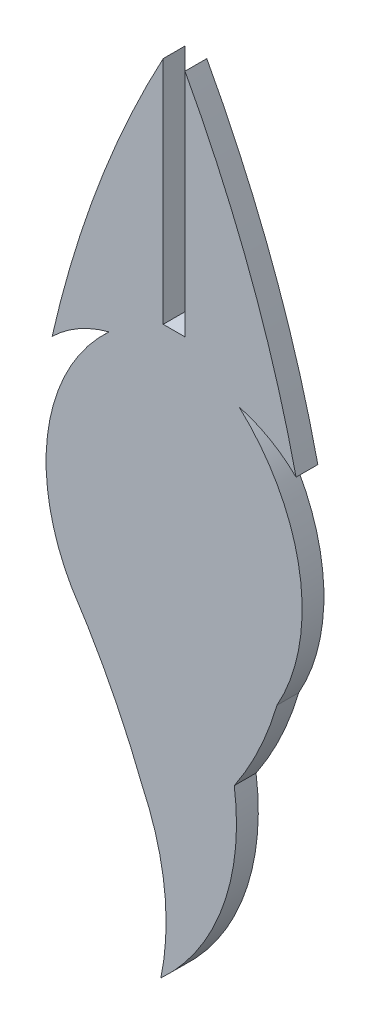
ISO-10303-21;
HEADER;
FILE_DESCRIPTION(('STEP AP214'),'2;1');
FILE_NAME('part.step','',(''),(''),'','','');
FILE_SCHEMA(('AUTOMOTIVE_DESIGN { 1 0 10303 214 1 1 1 1 }'));
ENDSEC;
DATA;
#1=APPLICATION_CONTEXT('core data for automotive mechanical design processes');
#2=APPLICATION_PROTOCOL_DEFINITION('international standard','automotive_design',2000,#1);
#3=PRODUCT_CONTEXT('',#1,'mechanical');
#4=PRODUCT('Part','Part','',(#3));
#5=PRODUCT_RELATED_PRODUCT_CATEGORY('part','',(#4));
#6=PRODUCT_DEFINITION_FORMATION('','',#4);
#7=PRODUCT_DEFINITION_CONTEXT('part definition',#1,'design');
#8=PRODUCT_DEFINITION('design','',#6,#7);
#9=PRODUCT_DEFINITION_SHAPE('','',#8);
#10=(LENGTH_UNIT() NAMED_UNIT(*) SI_UNIT(.MILLI.,.METRE.));
#11=(NAMED_UNIT(*) PLANE_ANGLE_UNIT() SI_UNIT($,.RADIAN.));
#12=(NAMED_UNIT(*) SI_UNIT($,.STERADIAN.) SOLID_ANGLE_UNIT());
#13=UNCERTAINTY_MEASURE_WITH_UNIT(LENGTH_MEASURE(1.E-05),#10,'distance_accuracy_value','');
#14=(GEOMETRIC_REPRESENTATION_CONTEXT(3) GLOBAL_UNCERTAINTY_ASSIGNED_CONTEXT((#13)) GLOBAL_UNIT_ASSIGNED_CONTEXT((#10,
#11,#12)) REPRESENTATION_CONTEXT('',''));
#15=CARTESIAN_POINT('',(0.,0.,0.));
#16=DIRECTION('',(0.,0.,1.));
#17=DIRECTION('',(1.,0.,0.));
#18=AXIS2_PLACEMENT_3D('',#15,#16,#17);
#19=CARTESIAN_POINT('',(-1.52400000000001,-18.5816019142866,1.524));
#20=DIRECTION('',(-1.,0.,0.));
#21=DIRECTION('',(0.,0.,1.));
#22=AXIS2_PLACEMENT_3D('',#19,#20,#21);
#23=PLANE('',#22);
#24=DIRECTION('',(0.,1.,0.));
#25=VECTOR('',#24,1.);
#26=CARTESIAN_POINT('',(-1.52400000000001,-18.5816019142866,0.));
#27=LINE('',#26,#25);
#28=CARTESIAN_POINT('',(-1.52400000000001,-34.6762018191849,0.));
#29=VERTEX_POINT('',#28);
#30=CARTESIAN_POINT('',(-1.524,-18.5816019142866,0.));
#31=VERTEX_POINT('',#30);
#32=EDGE_CURVE('E162',#29,#31,#27,.T.);
#33=ORIENTED_EDGE('',*,*,#32,.T.);
#34=DIRECTION('',(0.,0.,-1.));
#35=VECTOR('',#34,1.);
#36=CARTESIAN_POINT('',(-1.524,-18.5816019142866,1.524));
#37=LINE('',#36,#35);
#38=CARTESIAN_POINT('',(-1.524,-18.5816019142866,1.524));
#39=VERTEX_POINT('',#38);
#40=EDGE_CURVE('E11',#39,#31,#37,.T.);
#41=ORIENTED_EDGE('',*,*,#40,.F.);
#42=DIRECTION('',(0.,1.,0.));
#43=VECTOR('',#42,1.);
#44=CARTESIAN_POINT('',(-1.52400000000001,-18.5816019142866,1.524));
#45=LINE('',#44,#43);
#46=CARTESIAN_POINT('',(-1.52400000000001,-34.6762018191849,1.524));
#47=VERTEX_POINT('',#46);
#48=EDGE_CURVE('E186',#47,#39,#45,.T.);
#49=ORIENTED_EDGE('',*,*,#48,.F.);
#50=DIRECTION('',(0.,0.,-1.));
#51=VECTOR('',#50,1.);
#52=CARTESIAN_POINT('',(-1.52400000000001,-34.6762018191849,1.524));
#53=LINE('',#52,#51);
#54=EDGE_CURVE('E158',#47,#29,#53,.T.);
#55=ORIENTED_EDGE('',*,*,#54,.T.);
#56=EDGE_LOOP('',(#33,#41,#49,#55));
#57=FACE_BOUND('',#56,.T.);
#58=ADVANCED_FACE('F36',(#57),#23,.F.);
#59=CARTESIAN_POINT('',(70.4453125153491,-57.3849255412965,1.524));
#60=DIRECTION('',(0.,0.,-1.));
#61=DIRECTION('',(-1.,0.,0.));
#62=AXIS2_PLACEMENT_3D('',#59,#60,#61);
#63=CYLINDRICAL_SURFACE('',#62,81.7635607617138);
#64=CARTESIAN_POINT('',(70.4453125153491,-57.3849255412965,0.));
#65=DIRECTION('',(0.,0.,1.));
#66=DIRECTION('',(1.,0.,0.));
#67=AXIS2_PLACEMENT_3D('',#64,#65,#66);
#68=CIRCLE('',#67,81.7635607617138);
#69=CARTESIAN_POINT('',(-9.29048030385663,-39.2884283131822,0.));
#70=VERTEX_POINT('',#69);
#71=EDGE_CURVE('E165',#31,#70,#68,.T.);
#72=ORIENTED_EDGE('',*,*,#71,.T.);
#73=DIRECTION('',(0.,0.,-1.));
#74=VECTOR('',#73,1.);
#75=CARTESIAN_POINT('',(-9.29048030385663,-39.2884283131822,1.524));
#76=LINE('',#75,#74);
#77=CARTESIAN_POINT('',(-9.29048030385663,-39.2884283131822,1.524));
#78=VERTEX_POINT('',#77);
#79=EDGE_CURVE('E44',#78,#70,#76,.T.);
#80=ORIENTED_EDGE('',*,*,#79,.F.);
#81=CARTESIAN_POINT('',(70.4453125153491,-57.3849255412965,1.524));
#82=DIRECTION('',(0.,0.,1.));
#83=DIRECTION('',(1.,0.,0.));
#84=AXIS2_PLACEMENT_3D('',#81,#82,#83);
#85=CIRCLE('',#84,81.7635607617138);
#86=EDGE_CURVE('E110',#39,#78,#85,.T.);
#87=ORIENTED_EDGE('',*,*,#86,.F.);
#88=ORIENTED_EDGE('',*,*,#40,.T.);
#89=EDGE_LOOP('',(#72,#80,#87,#88));
#90=FACE_BOUND('',#89,.T.);
#91=ADVANCED_FACE('F269',(#90),#63,.T.);
#92=CARTESIAN_POINT('',(-3.00506683337598,-45.7155767584329,1.524));
#93=DIRECTION('',(0.,0.,-1.));
#94=DIRECTION('',(-1.,0.,0.));
#95=AXIS2_PLACEMENT_3D('',#92,#93,#94);
#96=CYLINDRICAL_SURFACE('',#95,8.98969741605289);
#97=CARTESIAN_POINT('',(-3.00506683337598,-45.7155767584329,0.));
#98=DIRECTION('',(0.,0.,-1.));
#99=DIRECTION('',(-1.,0.,0.));
#100=AXIS2_PLACEMENT_3D('',#97,#98,#99);
#101=CIRCLE('',#100,8.98969741605289);
#102=CARTESIAN_POINT('',(-5.30879681582961,-37.0260722961443,0.));
#103=VERTEX_POINT('',#102);
#104=EDGE_CURVE('E167',#70,#103,#101,.T.);
#105=ORIENTED_EDGE('',*,*,#104,.T.);
#106=DIRECTION('',(0.,0.,-1.));
#107=VECTOR('',#106,1.);
#108=CARTESIAN_POINT('',(-5.30879681582961,-37.0260722961443,1.524));
#109=LINE('',#108,#107);
#110=CARTESIAN_POINT('',(-5.30879681582961,-37.0260722961443,1.524));
#111=VERTEX_POINT('',#110);
#112=EDGE_CURVE('E208',#111,#103,#109,.T.);
#113=ORIENTED_EDGE('',*,*,#112,.F.);
#114=CARTESIAN_POINT('',(-3.00506683337598,-45.7155767584329,1.524));
#115=DIRECTION('',(0.,0.,-1.));
#116=DIRECTION('',(-1.,0.,0.));
#117=AXIS2_PLACEMENT_3D('',#114,#115,#116);
#118=CIRCLE('',#117,8.98969741605289);
#119=EDGE_CURVE('E216',#78,#111,#118,.T.);
#120=ORIENTED_EDGE('',*,*,#119,.F.);
#121=ORIENTED_EDGE('',*,*,#79,.T.);
#122=EDGE_LOOP('',(#105,#113,#120,#121));
#123=FACE_BOUND('',#122,.T.);
#124=ADVANCED_FACE('F214',(#123),#96,.F.);
#125=CARTESIAN_POINT('',(3.92555912112317,-47.0659354865016,1.524));
#126=DIRECTION('',(0.,0.,-1.));
#127=DIRECTION('',(-1.,0.,0.));
#128=AXIS2_PLACEMENT_3D('',#125,#126,#127);
#129=CYLINDRICAL_SURFACE('',#128,13.6408277773537);
#130=CARTESIAN_POINT('',(3.92555912112317,-47.0659354865016,0.));
#131=DIRECTION('',(0.,0.,1.));
#132=DIRECTION('',(1.,0.,0.));
#133=AXIS2_PLACEMENT_3D('',#130,#131,#132);
#134=CIRCLE('',#133,13.6408277773537);
#135=CARTESIAN_POINT('',(-7.95329549132107,-53.7715298335999,0.));
#136=VERTEX_POINT('',#135);
#137=EDGE_CURVE('E169',#103,#136,#134,.T.);
#138=ORIENTED_EDGE('',*,*,#137,.T.);
#139=DIRECTION('',(0.,0.,-1.));
#140=VECTOR('',#139,1.);
#141=CARTESIAN_POINT('',(-7.95329549132107,-53.7715298335999,1.524));
#142=LINE('',#141,#140);
#143=CARTESIAN_POINT('',(-7.95329549132107,-53.7715298335999,1.524));
#144=VERTEX_POINT('',#143);
#145=EDGE_CURVE('E205',#144,#136,#142,.T.);
#146=ORIENTED_EDGE('',*,*,#145,.F.);
#147=CARTESIAN_POINT('',(3.92555912112317,-47.0659354865016,1.524));
#148=DIRECTION('',(0.,0.,1.));
#149=DIRECTION('',(1.,0.,0.));
#150=AXIS2_PLACEMENT_3D('',#147,#148,#149);
#151=CIRCLE('',#150,13.6408277773537);
#152=EDGE_CURVE('E234',#111,#144,#151,.T.);
#153=ORIENTED_EDGE('',*,*,#152,.F.);
#154=ORIENTED_EDGE('',*,*,#112,.T.);
#155=EDGE_LOOP('',(#138,#146,#153,#154));
#156=FACE_BOUND('',#155,.T.);
#157=ADVANCED_FACE('F225',(#156),#129,.T.);
#158=CARTESIAN_POINT('',(-50.3528429648545,-81.7940691457981,1.524));
#159=DIRECTION('',(0.,0.,-1.));
#160=DIRECTION('',(-1.,0.,0.));
#161=AXIS2_PLACEMENT_3D('',#158,#159,#160);
#162=CYLINDRICAL_SURFACE('',#161,50.8230689300057);
#163=CARTESIAN_POINT('',(-50.3528429648545,-81.7940691457981,0.));
#164=DIRECTION('',(0.,0.,-1.));
#165=DIRECTION('',(1.,0.,0.));
#166=AXIS2_PLACEMENT_3D('',#163,#164,#165);
#167=CIRCLE('',#166,50.8230689300057);
#168=CARTESIAN_POINT('',(-3.00146917883711,-63.3324403974733,0.));
#169=VERTEX_POINT('',#168);
#170=EDGE_CURVE('E171',#136,#169,#167,.T.);
#171=ORIENTED_EDGE('',*,*,#170,.T.);
#172=DIRECTION('',(0.,0.,-1.));
#173=VECTOR('',#172,1.);
#174=CARTESIAN_POINT('',(-3.00146917883711,-63.3324403974733,1.524));
#175=LINE('',#174,#173);
#176=CARTESIAN_POINT('',(-3.00146917883711,-63.3324403974733,1.524));
#177=VERTEX_POINT('',#176);
#178=EDGE_CURVE('E202',#177,#169,#175,.T.);
#179=ORIENTED_EDGE('',*,*,#178,.F.);
#180=CARTESIAN_POINT('',(-50.3528429648545,-81.7940691457981,1.524));
#181=DIRECTION('',(0.,0.,-1.));
#182=DIRECTION('',(1.,0.,0.));
#183=AXIS2_PLACEMENT_3D('',#180,#181,#182);
#184=CIRCLE('',#183,50.8230689300057);
#185=EDGE_CURVE('E231',#144,#177,#184,.T.);
#186=ORIENTED_EDGE('',*,*,#185,.F.);
#187=ORIENTED_EDGE('',*,*,#145,.T.);
#188=EDGE_LOOP('',(#171,#179,#186,#187));
#189=FACE_BOUND('',#188,.T.);
#190=ADVANCED_FACE('F229',(#189),#162,.F.);
#191=CARTESIAN_POINT('',(-18.7415117303908,-70.7959639340754,1.524));
#192=DIRECTION('',(0.,0.,-1.));
#193=DIRECTION('',(-1.,0.,0.));
#194=AXIS2_PLACEMENT_3D('',#191,#192,#193);
#195=CYLINDRICAL_SURFACE('',#194,17.4199059442391);
#196=CARTESIAN_POINT('',(-18.7415117303908,-70.7959639340754,0.));
#197=DIRECTION('',(0.,0.,-1.));
#198=DIRECTION('',(-1.,0.,0.));
#199=AXIS2_PLACEMENT_3D('',#196,#197,#198);
#200=CIRCLE('',#199,17.4199059442391);
#201=CARTESIAN_POINT('',(-1.68743934656411,-74.3472648553343,0.));
#202=VERTEX_POINT('',#201);
#203=EDGE_CURVE('E173',#169,#202,#200,.T.);
#204=ORIENTED_EDGE('',*,*,#203,.T.);
#205=DIRECTION('',(0.,0.,-1.));
#206=VECTOR('',#205,1.);
#207=CARTESIAN_POINT('',(-1.68743934656411,-74.3472648553343,1.524));
#208=LINE('',#207,#206);
#209=CARTESIAN_POINT('',(-1.68743934656411,-74.3472648553343,1.524));
#210=VERTEX_POINT('',#209);
#211=EDGE_CURVE('E199',#210,#202,#208,.T.);
#212=ORIENTED_EDGE('',*,*,#211,.F.);
#213=CARTESIAN_POINT('',(-18.7415117303908,-70.7959639340754,1.524));
#214=DIRECTION('',(0.,0.,-1.));
#215=DIRECTION('',(-1.,0.,0.));
#216=AXIS2_PLACEMENT_3D('',#213,#214,#215);
#217=CIRCLE('',#216,17.4199059442391);
#218=EDGE_CURVE('E233',#177,#210,#217,.T.);
#219=ORIENTED_EDGE('',*,*,#218,.F.);
#220=ORIENTED_EDGE('',*,*,#178,.T.);
#221=EDGE_LOOP('',(#204,#212,#219,#220));
#222=FACE_BOUND('',#221,.T.);
#223=ADVANCED_FACE('F282',(#222),#195,.F.);
#224=CARTESIAN_POINT('',(-12.5949609513225,-62.3738585730274,1.524));
#225=DIRECTION('',(0.,0.,-1.));
#226=DIRECTION('',(-1.,0.,0.));
#227=AXIS2_PLACEMENT_3D('',#224,#225,#226);
#228=CYLINDRICAL_SURFACE('',#227,16.1968047947568);
#229=CARTESIAN_POINT('',(-12.5949609513225,-62.3738585730274,0.));
#230=DIRECTION('',(0.,0.,1.));
#231=DIRECTION('',(1.,0.,0.));
#232=AXIS2_PLACEMENT_3D('',#229,#230,#231);
#233=CIRCLE('',#232,16.1968047947568);
#234=CARTESIAN_POINT('',(3.44551482274413,-60.1289482182387,0.));
#235=VERTEX_POINT('',#234);
#236=EDGE_CURVE('E175',#202,#235,#233,.T.);
#237=ORIENTED_EDGE('',*,*,#236,.T.);
#238=DIRECTION('',(0.,0.,-1.));
#239=VECTOR('',#238,1.);
#240=CARTESIAN_POINT('',(3.44551482274413,-60.1289482182387,1.524));
#241=LINE('',#240,#239);
#242=CARTESIAN_POINT('',(3.44551482274413,-60.1289482182387,1.524));
#243=VERTEX_POINT('',#242);
#244=EDGE_CURVE('E196',#243,#235,#241,.T.);
#245=ORIENTED_EDGE('',*,*,#244,.F.);
#246=CARTESIAN_POINT('',(-12.5949609513225,-62.3738585730274,1.524));
#247=DIRECTION('',(0.,0.,1.));
#248=DIRECTION('',(1.,0.,0.));
#249=AXIS2_PLACEMENT_3D('',#246,#247,#248);
#250=CIRCLE('',#249,16.1968047947568);
#251=EDGE_CURVE('E236',#210,#243,#250,.T.);
#252=ORIENTED_EDGE('',*,*,#251,.F.);
#253=ORIENTED_EDGE('',*,*,#211,.T.);
#254=EDGE_LOOP('',(#237,#245,#252,#253));
#255=FACE_BOUND('',#254,.T.);
#256=ADVANCED_FACE('F285',(#255),#228,.T.);
#257=CARTESIAN_POINT('',(-15.5241285578103,-47.346855222314,1.524));
#258=DIRECTION('',(0.,0.,-1.));
#259=DIRECTION('',(-1.,0.,0.));
#260=AXIS2_PLACEMENT_3D('',#257,#258,#259);
#261=CYLINDRICAL_SURFACE('',#260,22.8742053707201);
#262=CARTESIAN_POINT('',(-15.5241285578103,-47.346855222314,0.));
#263=DIRECTION('',(0.,0.,1.));
#264=DIRECTION('',(-1.,0.,0.));
#265=AXIS2_PLACEMENT_3D('',#262,#263,#264);
#266=CIRCLE('',#265,22.8742053707201);
#267=CARTESIAN_POINT('',(6.42929549132104,-53.7715298335999,0.));
#268=VERTEX_POINT('',#267);
#269=EDGE_CURVE('E177',#235,#268,#266,.T.);
#270=ORIENTED_EDGE('',*,*,#269,.T.);
#271=DIRECTION('',(0.,0.,-1.));
#272=VECTOR('',#271,1.);
#273=CARTESIAN_POINT('',(6.42929549132104,-53.7715298335999,1.524));
#274=LINE('',#273,#272);
#275=CARTESIAN_POINT('',(6.42929549132104,-53.7715298335999,1.524));
#276=VERTEX_POINT('',#275);
#277=EDGE_CURVE('E193',#276,#268,#274,.T.);
#278=ORIENTED_EDGE('',*,*,#277,.F.);
#279=CARTESIAN_POINT('',(-15.5241285578103,-47.346855222314,1.524));
#280=DIRECTION('',(0.,0.,1.));
#281=DIRECTION('',(-1.,0.,0.));
#282=AXIS2_PLACEMENT_3D('',#279,#280,#281);
#283=CIRCLE('',#282,22.8742053707201);
#284=EDGE_CURVE('E242',#243,#276,#283,.T.);
#285=ORIENTED_EDGE('',*,*,#284,.F.);
#286=ORIENTED_EDGE('',*,*,#244,.T.);
#287=EDGE_LOOP('',(#270,#278,#285,#286));
#288=FACE_BOUND('',#287,.T.);
#289=ADVANCED_FACE('F289',(#288),#261,.T.);
#290=CARTESIAN_POINT('',(-5.44955912112319,-47.0659354865016,1.524));
#291=DIRECTION('',(0.,0.,-1.));
#292=DIRECTION('',(-1.,0.,0.));
#293=AXIS2_PLACEMENT_3D('',#290,#291,#292);
#294=CYLINDRICAL_SURFACE('',#293,13.6408277773537);
#295=CARTESIAN_POINT('',(-5.44955912112319,-47.0659354865016,0.));
#296=DIRECTION('',(0.,0.,1.));
#297=DIRECTION('',(-1.,0.,0.));
#298=AXIS2_PLACEMENT_3D('',#295,#296,#297);
#299=CIRCLE('',#298,13.6408277773537);
#300=CARTESIAN_POINT('',(3.78479681582959,-37.0260722961443,0.));
#301=VERTEX_POINT('',#300);
#302=EDGE_CURVE('E179',#268,#301,#299,.T.);
#303=ORIENTED_EDGE('',*,*,#302,.T.);
#304=DIRECTION('',(0.,0.,-1.));
#305=VECTOR('',#304,1.);
#306=CARTESIAN_POINT('',(3.78479681582959,-37.0260722961443,1.524));
#307=LINE('',#306,#305);
#308=CARTESIAN_POINT('',(3.78479681582959,-37.0260722961443,1.524));
#309=VERTEX_POINT('',#308);
#310=EDGE_CURVE('E190',#309,#301,#307,.T.);
#311=ORIENTED_EDGE('',*,*,#310,.F.);
#312=CARTESIAN_POINT('',(-5.44955912112319,-47.0659354865016,1.524));
#313=DIRECTION('',(0.,0.,1.));
#314=DIRECTION('',(-1.,0.,0.));
#315=AXIS2_PLACEMENT_3D('',#312,#313,#314);
#316=CIRCLE('',#315,13.6408277773537);
#317=EDGE_CURVE('E244',#276,#309,#316,.T.);
#318=ORIENTED_EDGE('',*,*,#317,.F.);
#319=ORIENTED_EDGE('',*,*,#277,.T.);
#320=EDGE_LOOP('',(#303,#311,#318,#319));
#321=FACE_BOUND('',#320,.T.);
#322=ADVANCED_FACE('F250',(#321),#294,.T.);
#323=CARTESIAN_POINT('',(1.48106683337597,-45.7155767584329,1.524));
#324=DIRECTION('',(0.,0.,-1.));
#325=DIRECTION('',(-1.,0.,0.));
#326=AXIS2_PLACEMENT_3D('',#323,#324,#325);
#327=CYLINDRICAL_SURFACE('',#326,8.98969741605289);
#328=CARTESIAN_POINT('',(1.48106683337597,-45.7155767584329,0.));
#329=DIRECTION('',(0.,0.,-1.));
#330=DIRECTION('',(1.,0.,0.));
#331=AXIS2_PLACEMENT_3D('',#328,#329,#330);
#332=CIRCLE('',#331,8.98969741605289);
#333=CARTESIAN_POINT('',(7.76648030385661,-39.2884283131822,0.));
#334=VERTEX_POINT('',#333);
#335=EDGE_CURVE('E181',#301,#334,#332,.T.);
#336=ORIENTED_EDGE('',*,*,#335,.T.);
#337=DIRECTION('',(0.,0.,-1.));
#338=VECTOR('',#337,1.);
#339=CARTESIAN_POINT('',(7.76648030385661,-39.2884283131822,1.524));
#340=LINE('',#339,#338);
#341=CARTESIAN_POINT('',(7.76648030385661,-39.2884283131822,1.524));
#342=VERTEX_POINT('',#341);
#343=EDGE_CURVE('E153',#342,#334,#340,.T.);
#344=ORIENTED_EDGE('',*,*,#343,.F.);
#345=CARTESIAN_POINT('',(1.48106683337597,-45.7155767584329,1.524));
#346=DIRECTION('',(0.,0.,-1.));
#347=DIRECTION('',(1.,0.,0.));
#348=AXIS2_PLACEMENT_3D('',#345,#346,#347);
#349=CIRCLE('',#348,8.98969741605289);
#350=EDGE_CURVE('E144',#309,#342,#349,.T.);
#351=ORIENTED_EDGE('',*,*,#350,.F.);
#352=ORIENTED_EDGE('',*,*,#310,.T.);
#353=EDGE_LOOP('',(#336,#344,#351,#352));
#354=FACE_BOUND('',#353,.T.);
#355=ADVANCED_FACE('F254',(#354),#327,.F.);
#356=CARTESIAN_POINT('',(-71.9693125153492,-57.3849255412965,1.524));
#357=DIRECTION('',(0.,0.,-1.));
#358=DIRECTION('',(-1.,0.,0.));
#359=AXIS2_PLACEMENT_3D('',#356,#357,#358);
#360=CYLINDRICAL_SURFACE('',#359,81.7635607617138);
#361=CARTESIAN_POINT('',(-71.9693125153492,-57.3849255412965,0.));
#362=DIRECTION('',(0.,0.,1.));
#363=DIRECTION('',(-1.,0.,0.));
#364=AXIS2_PLACEMENT_3D('',#361,#362,#363);
#365=CIRCLE('',#364,81.7635607617138);
#366=CARTESIAN_POINT('',(0.,-18.5816019142866,0.));
#367=VERTEX_POINT('',#366);
#368=EDGE_CURVE('E152',#334,#367,#365,.T.);
#369=ORIENTED_EDGE('',*,*,#368,.T.);
#370=DIRECTION('',(0.,0.,-1.));
#371=VECTOR('',#370,1.);
#372=CARTESIAN_POINT('',(0.,-18.5816019142866,1.524));
#373=LINE('',#372,#371);
#374=CARTESIAN_POINT('',(0.,-18.5816019142866,1.524));
#375=VERTEX_POINT('',#374);
#376=EDGE_CURVE('E149',#375,#367,#373,.T.);
#377=ORIENTED_EDGE('',*,*,#376,.F.);
#378=CARTESIAN_POINT('',(-71.9693125153492,-57.3849255412965,1.524));
#379=DIRECTION('',(0.,0.,1.));
#380=DIRECTION('',(-1.,0.,0.));
#381=AXIS2_PLACEMENT_3D('',#378,#379,#380);
#382=CIRCLE('',#381,81.7635607617138);
#383=EDGE_CURVE('E138',#342,#375,#382,.T.);
#384=ORIENTED_EDGE('',*,*,#383,.F.);
#385=ORIENTED_EDGE('',*,*,#343,.T.);
#386=EDGE_LOOP('',(#369,#377,#384,#385));
#387=FACE_BOUND('',#386,.T.);
#388=ADVANCED_FACE('F150',(#387),#360,.T.);
#389=CARTESIAN_POINT('',(0.,-34.6762018191849,1.524));
#390=DIRECTION('',(1.,0.,0.));
#391=DIRECTION('',(0.,1.,0.));
#392=AXIS2_PLACEMENT_3D('',#389,#390,#391);
#393=PLANE('',#392);
#394=DIRECTION('',(0.,-1.,0.));
#395=VECTOR('',#394,1.);
#396=CARTESIAN_POINT('',(0.,-34.6762018191849,0.));
#397=LINE('',#396,#395);
#398=CARTESIAN_POINT('',(0.,-34.6762018191849,0.));
#399=VERTEX_POINT('',#398);
#400=EDGE_CURVE('E96',#367,#399,#397,.T.);
#401=ORIENTED_EDGE('',*,*,#400,.T.);
#402=DIRECTION('',(0.,0.,-1.));
#403=VECTOR('',#402,1.);
#404=CARTESIAN_POINT('',(0.,-34.6762018191849,1.524));
#405=LINE('',#404,#403);
#406=CARTESIAN_POINT('',(0.,-34.6762018191849,1.524));
#407=VERTEX_POINT('',#406);
#408=EDGE_CURVE('E154',#407,#399,#405,.T.);
#409=ORIENTED_EDGE('',*,*,#408,.F.);
#410=DIRECTION('',(0.,-1.,0.));
#411=VECTOR('',#410,1.);
#412=CARTESIAN_POINT('',(0.,-34.6762018191849,1.524));
#413=LINE('',#412,#411);
#414=EDGE_CURVE('E142',#375,#407,#413,.T.);
#415=ORIENTED_EDGE('',*,*,#414,.F.);
#416=ORIENTED_EDGE('',*,*,#376,.T.);
#417=EDGE_LOOP('',(#401,#409,#415,#416));
#418=FACE_BOUND('',#417,.T.);
#419=ADVANCED_FACE('F156',(#418),#393,.F.);
#420=CARTESIAN_POINT('',(-1.52400000000001,-34.6762018191849,1.524));
#421=DIRECTION('',(0.,-1.,0.));
#422=DIRECTION('',(0.,0.,-1.));
#423=AXIS2_PLACEMENT_3D('',#420,#421,#422);
#424=PLANE('',#423);
#425=DIRECTION('',(-1.,0.,0.));
#426=VECTOR('',#425,1.);
#427=CARTESIAN_POINT('',(-1.52400000000001,-34.6762018191849,0.));
#428=LINE('',#427,#426);
#429=EDGE_CURVE('E102',#399,#29,#428,.T.);
#430=ORIENTED_EDGE('',*,*,#429,.T.);
#431=ORIENTED_EDGE('',*,*,#54,.F.);
#432=DIRECTION('',(-1.,0.,0.));
#433=VECTOR('',#432,1.);
#434=CARTESIAN_POINT('',(-1.52400000000001,-34.6762018191849,1.524));
#435=LINE('',#434,#433);
#436=EDGE_CURVE('E52',#407,#47,#435,.T.);
#437=ORIENTED_EDGE('',*,*,#436,.F.);
#438=ORIENTED_EDGE('',*,*,#408,.T.);
#439=EDGE_LOOP('',(#430,#431,#437,#438));
#440=FACE_BOUND('',#439,.T.);
#441=ADVANCED_FACE('F258',(#440),#424,.F.);
#442=CARTESIAN_POINT('',(-71.9693125153492,-57.3849255412965,1.524));
#443=DIRECTION('',(0.,0.,-1.));
#444=DIRECTION('',(-1.,0.,0.));
#445=AXIS2_PLACEMENT_3D('',#442,#443,#444);
#446=PLANE('',#445);
#447=ORIENTED_EDGE('',*,*,#48,.T.);
#448=ORIENTED_EDGE('',*,*,#86,.T.);
#449=ORIENTED_EDGE('',*,*,#119,.T.);
#450=ORIENTED_EDGE('',*,*,#152,.T.);
#451=ORIENTED_EDGE('',*,*,#185,.T.);
#452=ORIENTED_EDGE('',*,*,#218,.T.);
#453=ORIENTED_EDGE('',*,*,#251,.T.);
#454=ORIENTED_EDGE('',*,*,#284,.T.);
#455=ORIENTED_EDGE('',*,*,#317,.T.);
#456=ORIENTED_EDGE('',*,*,#350,.T.);
#457=ORIENTED_EDGE('',*,*,#383,.T.);
#458=ORIENTED_EDGE('',*,*,#414,.T.);
#459=ORIENTED_EDGE('',*,*,#436,.T.);
#460=EDGE_LOOP('',(#447,#448,#449,#450,#451,#452,#453,#454,#455,#456,#457,#458,#459));
#461=FACE_BOUND('',#460,.T.);
#462=ADVANCED_FACE('F140',(#461),#446,.F.);
#463=CARTESIAN_POINT('',(-71.9693125153492,-57.3849255412965,0.));
#464=DIRECTION('',(0.,0.,-1.));
#465=DIRECTION('',(-1.,0.,0.));
#466=AXIS2_PLACEMENT_3D('',#463,#464,#465);
#467=PLANE('',#466);
#468=ORIENTED_EDGE('',*,*,#32,.F.);
#469=ORIENTED_EDGE('',*,*,#429,.F.);
#470=ORIENTED_EDGE('',*,*,#400,.F.);
#471=ORIENTED_EDGE('',*,*,#368,.F.);
#472=ORIENTED_EDGE('',*,*,#335,.F.);
#473=ORIENTED_EDGE('',*,*,#302,.F.);
#474=ORIENTED_EDGE('',*,*,#269,.F.);
#475=ORIENTED_EDGE('',*,*,#236,.F.);
#476=ORIENTED_EDGE('',*,*,#203,.F.);
#477=ORIENTED_EDGE('',*,*,#170,.F.);
#478=ORIENTED_EDGE('',*,*,#137,.F.);
#479=ORIENTED_EDGE('',*,*,#104,.F.);
#480=ORIENTED_EDGE('',*,*,#71,.F.);
#481=EDGE_LOOP('',(#468,#469,#470,#471,#472,#473,#474,#475,#476,#477,#478,#479,#480));
#482=FACE_BOUND('',#481,.T.);
#483=ADVANCED_FACE('F220',(#482),#467,.T.);
#484=CLOSED_SHELL('',(#58,#91,#124,#157,#190,#223,#256,#289,#322,#355,#388,#419,#441,#462,#483));
#485=MANIFOLD_SOLID_BREP('B2',#484);
#486=ADVANCED_BREP_SHAPE_REPRESENTATION('',(#18,#485),#14);
#487=SHAPE_DEFINITION_REPRESENTATION(#9,#486);
ENDSEC;
END-ISO-10303-21;
